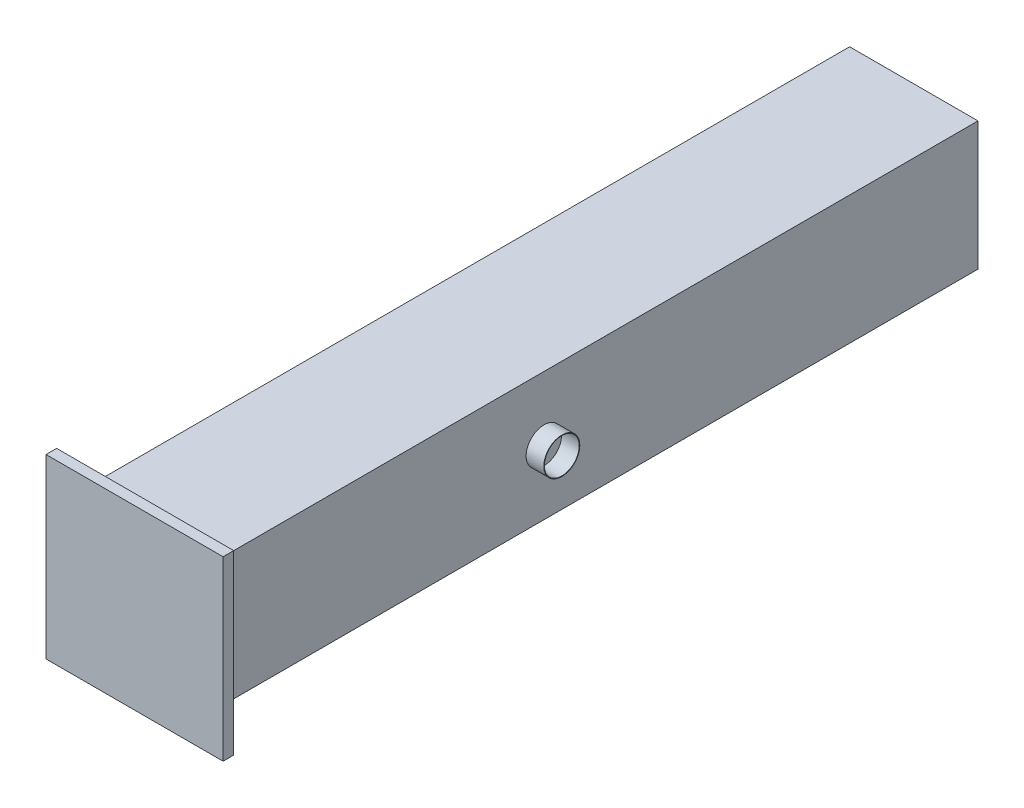
ISO-10303-21;
HEADER;
FILE_DESCRIPTION(('STEP AP214'),'2;1');
FILE_NAME('part.step','',(''),(''),'','','');
FILE_SCHEMA(('AUTOMOTIVE_DESIGN { 1 0 10303 214 1 1 1 1 }'));
ENDSEC;
DATA;
#1=APPLICATION_CONTEXT('core data for automotive mechanical design processes');
#2=APPLICATION_PROTOCOL_DEFINITION('international standard','automotive_design',2000,#1);
#3=PRODUCT_CONTEXT('',#1,'mechanical');
#4=PRODUCT('Part','Part','',(#3));
#5=PRODUCT_RELATED_PRODUCT_CATEGORY('part','',(#4));
#6=PRODUCT_DEFINITION_FORMATION('','',#4);
#7=PRODUCT_DEFINITION_CONTEXT('part definition',#1,'design');
#8=PRODUCT_DEFINITION('design','',#6,#7);
#9=PRODUCT_DEFINITION_SHAPE('','',#8);
#10=(LENGTH_UNIT() NAMED_UNIT(*) SI_UNIT(.MILLI.,.METRE.));
#11=(NAMED_UNIT(*) PLANE_ANGLE_UNIT() SI_UNIT($,.RADIAN.));
#12=(NAMED_UNIT(*) SI_UNIT($,.STERADIAN.) SOLID_ANGLE_UNIT());
#13=UNCERTAINTY_MEASURE_WITH_UNIT(LENGTH_MEASURE(1.E-05),#10,'distance_accuracy_value','');
#14=(GEOMETRIC_REPRESENTATION_CONTEXT(3) GLOBAL_UNCERTAINTY_ASSIGNED_CONTEXT((#13)) GLOBAL_UNIT_ASSIGNED_CONTEXT((#10,
#11,#12)) REPRESENTATION_CONTEXT('',''));
#15=CARTESIAN_POINT('',(0.,0.,0.));
#16=DIRECTION('',(0.,0.,1.));
#17=DIRECTION('',(1.,0.,0.));
#18=AXIS2_PLACEMENT_3D('',#15,#16,#17);
#19=CARTESIAN_POINT('',(-725.,-725.,8680.));
#20=DIRECTION('',(0.,1.,0.));
#21=DIRECTION('',(0.,0.,1.));
#22=AXIS2_PLACEMENT_3D('',#19,#20,#21);
#23=PLANE('',#22);
#24=DIRECTION('',(1.,0.,0.));
#25=VECTOR('',#24,1.);
#26=CARTESIAN_POINT('',(-725.,-725.,0.));
#27=LINE('',#26,#25);
#28=CARTESIAN_POINT('',(-725.,-725.,0.));
#29=VERTEX_POINT('',#28);
#30=CARTESIAN_POINT('',(725.,-725.,0.));
#31=VERTEX_POINT('',#30);
#32=EDGE_CURVE('E345',#29,#31,#27,.T.);
#33=ORIENTED_EDGE('',*,*,#32,.T.);
#34=DIRECTION('',(0.,0.,-1.));
#35=VECTOR('',#34,1.);
#36=CARTESIAN_POINT('',(725.,-725.,8680.));
#37=LINE('',#36,#35);
#38=CARTESIAN_POINT('',(725.,-725.,8680.));
#39=VERTEX_POINT('',#38);
#40=EDGE_CURVE('E351',#39,#31,#37,.T.);
#41=ORIENTED_EDGE('',*,*,#40,.F.);
#42=DIRECTION('',(1.,0.,0.));
#43=VECTOR('',#42,1.);
#44=CARTESIAN_POINT('',(-725.,-725.,8680.));
#45=LINE('',#44,#43);
#46=CARTESIAN_POINT('',(-725.,-725.,8680.));
#47=VERTEX_POINT('',#46);
#48=EDGE_CURVE('E110',#47,#39,#45,.T.);
#49=ORIENTED_EDGE('',*,*,#48,.F.);
#50=DIRECTION('',(0.,0.,-1.));
#51=VECTOR('',#50,1.);
#52=CARTESIAN_POINT('',(-725.,-725.,8680.));
#53=LINE('',#52,#51);
#54=EDGE_CURVE('E353',#47,#29,#53,.T.);
#55=ORIENTED_EDGE('',*,*,#54,.T.);
#56=EDGE_LOOP('',(#33,#41,#49,#55));
#57=FACE_BOUND('',#56,.T.);
#58=CARTESIAN_POINT('',(0.,-725.,1500.));
#59=DIRECTION('',(0.,1.,0.));
#60=DIRECTION('',(0.,0.,1.));
#61=AXIS2_PLACEMENT_3D('',#58,#59,#60);
#62=CIRCLE('',#61,254.);
#63=CARTESIAN_POINT('',(0.,-725.,1754.));
#64=VERTEX_POINT('',#63);
#65=EDGE_CURVE('E355',#64,#64,#62,.F.);
#66=ORIENTED_EDGE('',*,*,#65,.F.);
#67=EDGE_LOOP('',(#66));
#68=FACE_BOUND('',#67,.T.);
#69=CARTESIAN_POINT('',(0.,-725.,4900.));
#70=DIRECTION('',(0.,1.,0.));
#71=DIRECTION('',(0.,0.,1.));
#72=AXIS2_PLACEMENT_3D('',#69,#70,#71);
#73=CIRCLE('',#72,161.95);
#74=CARTESIAN_POINT('',(0.,-725.,5061.95));
#75=VERTEX_POINT('',#74);
#76=EDGE_CURVE('E358',#75,#75,#73,.F.);
#77=ORIENTED_EDGE('',*,*,#76,.F.);
#78=EDGE_LOOP('',(#77));
#79=FACE_BOUND('',#78,.T.);
#80=CARTESIAN_POINT('',(0.,-725.,35.));
#81=DIRECTION('',(0.,1.,0.));
#82=DIRECTION('',(0.,0.,1.));
#83=AXIS2_PLACEMENT_3D('',#80,#81,#82);
#84=CIRCLE('',#83,17.15);
#85=CARTESIAN_POINT('',(0.,-725.,52.15));
#86=VERTEX_POINT('',#85);
#87=EDGE_CURVE('E12',#86,#86,#84,.F.);
#88=ORIENTED_EDGE('',*,*,#87,.F.);
#89=EDGE_LOOP('',(#88));
#90=FACE_BOUND('',#89,.T.);
#91=ADVANCED_FACE('F66',(#57,#68,#79,#90),#23,.F.);
#92=CARTESIAN_POINT('',(725.,725.,8680.));
#93=DIRECTION('',(-1.,0.,0.));
#94=DIRECTION('',(0.,-1.,0.));
#95=AXIS2_PLACEMENT_3D('',#92,#93,#94);
#96=PLANE('',#95);
#97=DIRECTION('',(0.,1.,0.));
#98=VECTOR('',#97,1.);
#99=CARTESIAN_POINT('',(725.,725.,0.));
#100=LINE('',#99,#98);
#101=CARTESIAN_POINT('',(725.,725.,0.));
#102=VERTEX_POINT('',#101);
#103=EDGE_CURVE('E99',#31,#102,#100,.T.);
#104=ORIENTED_EDGE('',*,*,#103,.T.);
#105=DIRECTION('',(0.,0.,-1.));
#106=VECTOR('',#105,1.);
#107=CARTESIAN_POINT('',(725.,725.,8680.));
#108=LINE('',#107,#106);
#109=CARTESIAN_POINT('',(725.,725.,8680.));
#110=VERTEX_POINT('',#109);
#111=EDGE_CURVE('E83',#110,#102,#108,.T.);
#112=ORIENTED_EDGE('',*,*,#111,.F.);
#113=DIRECTION('',(0.,1.,0.));
#114=VECTOR('',#113,1.);
#115=CARTESIAN_POINT('',(725.,725.,8680.));
#116=LINE('',#115,#114);
#117=EDGE_CURVE('E336',#39,#110,#116,.T.);
#118=ORIENTED_EDGE('',*,*,#117,.F.);
#119=ORIENTED_EDGE('',*,*,#40,.T.);
#120=EDGE_LOOP('',(#104,#112,#118,#119));
#121=FACE_BOUND('',#120,.T.);
#122=CARTESIAN_POINT('',(725.,-5.44565780350945E-13,4900.));
#123=DIRECTION('',(-1.,0.,0.));
#124=DIRECTION('',(0.,-1.,0.));
#125=AXIS2_PLACEMENT_3D('',#122,#123,#124);
#126=CIRCLE('',#125,203.2);
#127=CARTESIAN_POINT('',(725.,-203.2,4900.));
#128=VERTEX_POINT('',#127);
#129=EDGE_CURVE('E75',#128,#128,#126,.F.);
#130=ORIENTED_EDGE('',*,*,#129,.F.);
#131=EDGE_LOOP('',(#130));
#132=FACE_BOUND('',#131,.T.);
#133=ADVANCED_FACE('F371',(#121,#132),#96,.F.);
#134=CARTESIAN_POINT('',(-725.,725.,8680.));
#135=DIRECTION('',(1.,0.,0.));
#136=DIRECTION('',(0.,1.,0.));
#137=AXIS2_PLACEMENT_3D('',#134,#135,#136);
#138=PLANE('',#137);
#139=DIRECTION('',(0.,-1.,0.));
#140=VECTOR('',#139,1.);
#141=CARTESIAN_POINT('',(-725.,725.,0.));
#142=LINE('',#141,#140);
#143=CARTESIAN_POINT('',(-725.,725.,0.));
#144=VERTEX_POINT('',#143);
#145=EDGE_CURVE('E331',#144,#29,#142,.T.);
#146=ORIENTED_EDGE('',*,*,#145,.T.);
#147=ORIENTED_EDGE('',*,*,#54,.F.);
#148=DIRECTION('',(0.,-1.,0.));
#149=VECTOR('',#148,1.);
#150=CARTESIAN_POINT('',(-725.,725.,8680.));
#151=LINE('',#150,#149);
#152=CARTESIAN_POINT('',(-725.,725.,8680.));
#153=VERTEX_POINT('',#152);
#154=EDGE_CURVE('E332',#153,#47,#151,.T.);
#155=ORIENTED_EDGE('',*,*,#154,.F.);
#156=DIRECTION('',(0.,0.,-1.));
#157=VECTOR('',#156,1.);
#158=CARTESIAN_POINT('',(-725.,725.,8680.));
#159=LINE('',#158,#157);
#160=EDGE_CURVE('E342',#153,#144,#159,.T.);
#161=ORIENTED_EDGE('',*,*,#160,.T.);
#162=EDGE_LOOP('',(#146,#147,#155,#161));
#163=FACE_BOUND('',#162,.T.);
#164=CARTESIAN_POINT('',(-725.,0.,4900.));
#165=DIRECTION('',(1.,0.,0.));
#166=DIRECTION('',(0.,1.,0.));
#167=AXIS2_PLACEMENT_3D('',#164,#165,#166);
#168=CIRCLE('',#167,304.999999999999);
#169=CARTESIAN_POINT('',(-725.,304.999999999999,4900.));
#170=VERTEX_POINT('',#169);
#171=EDGE_CURVE('E361',#170,#170,#168,.F.);
#172=ORIENTED_EDGE('',*,*,#171,.F.);
#173=EDGE_LOOP('',(#172));
#174=FACE_BOUND('',#173,.T.);
#175=CARTESIAN_POINT('',(-725.,0.,1000.));
#176=DIRECTION('',(1.,0.,0.));
#177=DIRECTION('',(0.,1.,0.));
#178=AXIS2_PLACEMENT_3D('',#175,#176,#177);
#179=CIRCLE('',#178,305.);
#180=CARTESIAN_POINT('',(-725.,305.,1000.));
#181=VERTEX_POINT('',#180);
#182=EDGE_CURVE('E364',#181,#181,#179,.F.);
#183=ORIENTED_EDGE('',*,*,#182,.F.);
#184=EDGE_LOOP('',(#183));
#185=FACE_BOUND('',#184,.T.);
#186=ADVANCED_FACE('F373',(#163,#174,#185),#138,.F.);
#187=CARTESIAN_POINT('',(-725.,725.,8680.));
#188=DIRECTION('',(0.,-1.,0.));
#189=DIRECTION('',(0.,0.,-1.));
#190=AXIS2_PLACEMENT_3D('',#187,#188,#189);
#191=PLANE('',#190);
#192=DIRECTION('',(-1.,0.,0.));
#193=VECTOR('',#192,1.);
#194=CARTESIAN_POINT('',(-725.,725.,0.));
#195=LINE('',#194,#193);
#196=EDGE_CURVE('E104',#102,#144,#195,.T.);
#197=ORIENTED_EDGE('',*,*,#196,.T.);
#198=ORIENTED_EDGE('',*,*,#160,.F.);
#199=DIRECTION('',(-1.,0.,0.));
#200=VECTOR('',#199,1.);
#201=CARTESIAN_POINT('',(-725.,725.,8680.));
#202=LINE('',#201,#200);
#203=EDGE_CURVE('E339',#110,#153,#202,.T.);
#204=ORIENTED_EDGE('',*,*,#203,.F.);
#205=ORIENTED_EDGE('',*,*,#111,.T.);
#206=EDGE_LOOP('',(#197,#198,#204,#205));
#207=FACE_BOUND('',#206,.T.);
#208=ADVANCED_FACE('F380',(#207),#191,.F.);
#209=CARTESIAN_POINT('',(-725.,-725.,0.));
#210=DIRECTION('',(0.,0.,1.));
#211=DIRECTION('',(1.,0.,0.));
#212=AXIS2_PLACEMENT_3D('',#209,#210,#211);
#213=PLANE('',#212);
#214=ORIENTED_EDGE('',*,*,#145,.F.);
#215=ORIENTED_EDGE('',*,*,#196,.F.);
#216=ORIENTED_EDGE('',*,*,#103,.F.);
#217=ORIENTED_EDGE('',*,*,#32,.F.);
#218=EDGE_LOOP('',(#214,#215,#216,#217));
#219=FACE_BOUND('',#218,.T.);
#220=ADVANCED_FACE('F503',(#219),#213,.F.);
#221=CARTESIAN_POINT('',(-1000.,1000.,8680.));
#222=DIRECTION('',(0.,0.,1.));
#223=DIRECTION('',(1.,0.,0.));
#224=AXIS2_PLACEMENT_3D('',#221,#222,#223);
#225=PLANE('',#224);
#226=DIRECTION('',(-1.,0.,0.));
#227=VECTOR('',#226,1.);
#228=CARTESIAN_POINT('',(1000.,1000.,8680.));
#229=LINE('',#228,#227);
#230=CARTESIAN_POINT('',(1000.,1000.,8680.));
#231=VERTEX_POINT('',#230);
#232=CARTESIAN_POINT('',(-1000.,1000.,8680.));
#233=VERTEX_POINT('',#232);
#234=EDGE_CURVE('E301',#231,#233,#229,.T.);
#235=ORIENTED_EDGE('',*,*,#234,.F.);
#236=DIRECTION('',(0.,1.,0.));
#237=VECTOR('',#236,1.);
#238=CARTESIAN_POINT('',(1000.,-1000.,8680.));
#239=LINE('',#238,#237);
#240=CARTESIAN_POINT('',(1000.,-1000.,8680.));
#241=VERTEX_POINT('',#240);
#242=EDGE_CURVE('E306',#241,#231,#239,.T.);
#243=ORIENTED_EDGE('',*,*,#242,.F.);
#244=DIRECTION('',(1.,0.,0.));
#245=VECTOR('',#244,1.);
#246=CARTESIAN_POINT('',(-1000.,-1000.,8680.));
#247=LINE('',#246,#245);
#248=CARTESIAN_POINT('',(-1000.,-1000.,8680.));
#249=VERTEX_POINT('',#248);
#250=EDGE_CURVE('E317',#249,#241,#247,.T.);
#251=ORIENTED_EDGE('',*,*,#250,.F.);
#252=DIRECTION('',(0.,-1.,0.));
#253=VECTOR('',#252,1.);
#254=CARTESIAN_POINT('',(-1000.,1000.,8680.));
#255=LINE('',#254,#253);
#256=EDGE_CURVE('E315',#233,#249,#255,.T.);
#257=ORIENTED_EDGE('',*,*,#256,.F.);
#258=EDGE_LOOP('',(#235,#243,#251,#257));
#259=FACE_BOUND('',#258,.T.);
#260=ORIENTED_EDGE('',*,*,#203,.T.);
#261=ORIENTED_EDGE('',*,*,#154,.T.);
#262=ORIENTED_EDGE('',*,*,#48,.T.);
#263=ORIENTED_EDGE('',*,*,#117,.T.);
#264=EDGE_LOOP('',(#260,#261,#262,#263));
#265=FACE_BOUND('',#264,.T.);
#266=ADVANCED_FACE('F499',(#259,#265),#225,.F.);
#267=CARTESIAN_POINT('',(1000.,1000.,8800.));
#268=DIRECTION('',(0.,-1.,0.));
#269=DIRECTION('',(0.,0.,-1.));
#270=AXIS2_PLACEMENT_3D('',#267,#268,#269);
#271=PLANE('',#270);
#272=ORIENTED_EDGE('',*,*,#234,.T.);
#273=DIRECTION('',(0.,0.,-1.));
#274=VECTOR('',#273,1.);
#275=CARTESIAN_POINT('',(-1000.,1000.,8800.));
#276=LINE('',#275,#274);
#277=CARTESIAN_POINT('',(-1000.,1000.,8800.));
#278=VERTEX_POINT('',#277);
#279=EDGE_CURVE('E328',#278,#233,#276,.T.);
#280=ORIENTED_EDGE('',*,*,#279,.F.);
#281=DIRECTION('',(-1.,0.,0.));
#282=VECTOR('',#281,1.);
#283=CARTESIAN_POINT('',(1000.,1000.,8800.));
#284=LINE('',#283,#282);
#285=CARTESIAN_POINT('',(1000.,1000.,8800.));
#286=VERTEX_POINT('',#285);
#287=EDGE_CURVE('E302',#286,#278,#284,.T.);
#288=ORIENTED_EDGE('',*,*,#287,.F.);
#289=DIRECTION('',(0.,0.,-1.));
#290=VECTOR('',#289,1.);
#291=CARTESIAN_POINT('',(1000.,1000.,8800.));
#292=LINE('',#291,#290);
#293=EDGE_CURVE('E312',#286,#231,#292,.T.);
#294=ORIENTED_EDGE('',*,*,#293,.T.);
#295=EDGE_LOOP('',(#272,#280,#288,#294));
#296=FACE_BOUND('',#295,.T.);
#297=ADVANCED_FACE('F502',(#296),#271,.F.);
#298=CARTESIAN_POINT('',(-1000.,1000.,8800.));
#299=DIRECTION('',(1.,0.,0.));
#300=DIRECTION('',(0.,1.,0.));
#301=AXIS2_PLACEMENT_3D('',#298,#299,#300);
#302=PLANE('',#301);
#303=ORIENTED_EDGE('',*,*,#256,.T.);
#304=DIRECTION('',(0.,0.,-1.));
#305=VECTOR('',#304,1.);
#306=CARTESIAN_POINT('',(-1000.,-1000.,8800.));
#307=LINE('',#306,#305);
#308=CARTESIAN_POINT('',(-1000.,-1000.,8800.));
#309=VERTEX_POINT('',#308);
#310=EDGE_CURVE('E325',#309,#249,#307,.T.);
#311=ORIENTED_EDGE('',*,*,#310,.F.);
#312=DIRECTION('',(0.,-1.,0.));
#313=VECTOR('',#312,1.);
#314=CARTESIAN_POINT('',(-1000.,1000.,8800.));
#315=LINE('',#314,#313);
#316=EDGE_CURVE('E305',#278,#309,#315,.T.);
#317=ORIENTED_EDGE('',*,*,#316,.F.);
#318=ORIENTED_EDGE('',*,*,#279,.T.);
#319=EDGE_LOOP('',(#303,#311,#317,#318));
#320=FACE_BOUND('',#319,.T.);
#321=ADVANCED_FACE('F511',(#320),#302,.F.);
#322=CARTESIAN_POINT('',(-1000.,-1000.,8800.));
#323=DIRECTION('',(0.,1.,0.));
#324=DIRECTION('',(0.,0.,1.));
#325=AXIS2_PLACEMENT_3D('',#322,#323,#324);
#326=PLANE('',#325);
#327=ORIENTED_EDGE('',*,*,#250,.T.);
#328=DIRECTION('',(0.,0.,-1.));
#329=VECTOR('',#328,1.);
#330=CARTESIAN_POINT('',(1000.,-1000.,8800.));
#331=LINE('',#330,#329);
#332=CARTESIAN_POINT('',(1000.,-1000.,8800.));
#333=VERTEX_POINT('',#332);
#334=EDGE_CURVE('E322',#333,#241,#331,.T.);
#335=ORIENTED_EDGE('',*,*,#334,.F.);
#336=DIRECTION('',(1.,0.,0.));
#337=VECTOR('',#336,1.);
#338=CARTESIAN_POINT('',(-1000.,-1000.,8800.));
#339=LINE('',#338,#337);
#340=EDGE_CURVE('E308',#309,#333,#339,.T.);
#341=ORIENTED_EDGE('',*,*,#340,.F.);
#342=ORIENTED_EDGE('',*,*,#310,.T.);
#343=EDGE_LOOP('',(#327,#335,#341,#342));
#344=FACE_BOUND('',#343,.T.);
#345=ADVANCED_FACE('F507',(#344),#326,.F.);
#346=CARTESIAN_POINT('',(1000.,-1000.,8800.));
#347=DIRECTION('',(-1.,0.,0.));
#348=DIRECTION('',(0.,-1.,0.));
#349=AXIS2_PLACEMENT_3D('',#346,#347,#348);
#350=PLANE('',#349);
#351=ORIENTED_EDGE('',*,*,#242,.T.);
#352=ORIENTED_EDGE('',*,*,#293,.F.);
#353=DIRECTION('',(0.,1.,0.));
#354=VECTOR('',#353,1.);
#355=CARTESIAN_POINT('',(1000.,-1000.,8800.));
#356=LINE('',#355,#354);
#357=EDGE_CURVE('E310',#333,#286,#356,.T.);
#358=ORIENTED_EDGE('',*,*,#357,.F.);
#359=ORIENTED_EDGE('',*,*,#334,.T.);
#360=EDGE_LOOP('',(#351,#352,#358,#359));
#361=FACE_BOUND('',#360,.T.);
#362=ADVANCED_FACE('F497',(#361),#350,.F.);
#363=CARTESIAN_POINT('',(-1000.,1000.,8800.));
#364=DIRECTION('',(0.,0.,1.));
#365=DIRECTION('',(1.,0.,0.));
#366=AXIS2_PLACEMENT_3D('',#363,#364,#365);
#367=PLANE('',#366);
#368=ORIENTED_EDGE('',*,*,#287,.T.);
#369=ORIENTED_EDGE('',*,*,#316,.T.);
#370=ORIENTED_EDGE('',*,*,#340,.T.);
#371=ORIENTED_EDGE('',*,*,#357,.T.);
#372=EDGE_LOOP('',(#368,#369,#370,#371));
#373=FACE_BOUND('',#372,.T.);
#374=ADVANCED_FACE('F490',(#373),#367,.T.);
#375=CARTESIAN_POINT('',(0.,-925.,1500.));
#376=DIRECTION('',(0.,-1.,0.));
#377=DIRECTION('',(0.,0.,-1.));
#378=AXIS2_PLACEMENT_3D('',#375,#376,#377);
#379=PLANE('',#378);
#380=CARTESIAN_POINT('',(0.,-925.,1500.));
#381=DIRECTION('',(0.,-1.,0.));
#382=DIRECTION('',(0.,0.,-1.));
#383=AXIS2_PLACEMENT_3D('',#380,#381,#382);
#384=CIRCLE('',#383,254.);
#385=CARTESIAN_POINT('',(0.,-925.,1246.));
#386=VERTEX_POINT('',#385);
#387=EDGE_CURVE('E296',#386,#386,#384,.T.);
#388=ORIENTED_EDGE('',*,*,#387,.T.);
#389=EDGE_LOOP('',(#388));
#390=FACE_BOUND('',#389,.T.);
#391=CARTESIAN_POINT('',(0.,-925.,1500.));
#392=DIRECTION('',(0.,-1.,0.));
#393=DIRECTION('',(1.,0.,0.));
#394=AXIS2_PLACEMENT_3D('',#391,#392,#393);
#395=CIRCLE('',#394,247.7);
#396=CARTESIAN_POINT('',(247.7,-925.,1500.));
#397=VERTEX_POINT('',#396);
#398=EDGE_CURVE('E293',#397,#397,#395,.T.);
#399=ORIENTED_EDGE('',*,*,#398,.F.);
#400=EDGE_LOOP('',(#399));
#401=FACE_BOUND('',#400,.T.);
#402=ADVANCED_FACE('F487',(#390,#401),#379,.T.);
#403=CARTESIAN_POINT('',(0.,-925.,1500.));
#404=DIRECTION('',(0.,1.,0.));
#405=DIRECTION('',(0.,0.,1.));
#406=AXIS2_PLACEMENT_3D('',#403,#404,#405);
#407=CYLINDRICAL_SURFACE('',#406,254.);
#408=ORIENTED_EDGE('',*,*,#387,.F.);
#409=EDGE_LOOP('',(#408));
#410=FACE_BOUND('',#409,.T.);
#411=ORIENTED_EDGE('',*,*,#65,.T.);
#412=EDGE_LOOP('',(#411));
#413=FACE_BOUND('',#412,.T.);
#414=ADVANCED_FACE('F485',(#410,#413),#407,.T.);
#415=CARTESIAN_POINT('',(0.,-925.,1500.));
#416=DIRECTION('',(0.,1.,0.));
#417=DIRECTION('',(0.,0.,1.));
#418=AXIS2_PLACEMENT_3D('',#415,#416,#417);
#419=CYLINDRICAL_SURFACE('',#418,247.7);
#420=ORIENTED_EDGE('',*,*,#398,.T.);
#421=EDGE_LOOP('',(#420));
#422=FACE_BOUND('',#421,.T.);
#423=CARTESIAN_POINT('',(0.,-725.,1500.));
#424=DIRECTION('',(0.,-1.,0.));
#425=DIRECTION('',(1.,0.,0.));
#426=AXIS2_PLACEMENT_3D('',#423,#424,#425);
#427=CIRCLE('',#426,247.7);
#428=CARTESIAN_POINT('',(247.7,-725.,1500.));
#429=VERTEX_POINT('',#428);
#430=EDGE_CURVE('E292',#429,#429,#427,.T.);
#431=ORIENTED_EDGE('',*,*,#430,.F.);
#432=EDGE_LOOP('',(#431));
#433=FACE_BOUND('',#432,.T.);
#434=ADVANCED_FACE('F482',(#422,#433),#419,.F.);
#435=CARTESIAN_POINT('',(0.,-725.,1500.));
#436=DIRECTION('',(0.,1.,0.));
#437=DIRECTION('',(0.,0.,1.));
#438=AXIS2_PLACEMENT_3D('',#435,#436,#437);
#439=CIRCLE('',#438,244.);
#440=CARTESIAN_POINT('',(0.,-725.,1744.));
#441=VERTEX_POINT('',#440);
#442=EDGE_CURVE('E252',#441,#441,#439,.T.);
#443=ORIENTED_EDGE('',*,*,#442,.T.);
#444=EDGE_LOOP('',(#443));
#445=FACE_BOUND('',#444,.T.);
#446=ORIENTED_EDGE('',*,*,#430,.T.);
#447=EDGE_LOOP('',(#446));
#448=FACE_BOUND('',#447,.T.);
#449=ADVANCED_FACE('F384',(#445,#448),#23,.F.);
#450=CARTESIAN_POINT('',(0.,-925.,4900.));
#451=DIRECTION('',(0.,-1.,0.));
#452=DIRECTION('',(0.,0.,-1.));
#453=AXIS2_PLACEMENT_3D('',#450,#451,#452);
#454=PLANE('',#453);
#455=CARTESIAN_POINT('',(0.,-925.,4900.));
#456=DIRECTION('',(0.,-1.,0.));
#457=DIRECTION('',(0.,0.,-1.));
#458=AXIS2_PLACEMENT_3D('',#455,#456,#457);
#459=CIRCLE('',#458,161.95);
#460=CARTESIAN_POINT('',(0.,-925.,4738.05));
#461=VERTEX_POINT('',#460);
#462=EDGE_CURVE('E287',#461,#461,#459,.T.);
#463=ORIENTED_EDGE('',*,*,#462,.T.);
#464=EDGE_LOOP('',(#463));
#465=FACE_BOUND('',#464,.T.);
#466=CARTESIAN_POINT('',(0.,-925.,4900.));
#467=DIRECTION('',(0.,-1.,0.));
#468=DIRECTION('',(1.,0.,0.));
#469=AXIS2_PLACEMENT_3D('',#466,#467,#468);
#470=CIRCLE('',#469,155.65);
#471=CARTESIAN_POINT('',(155.65,-925.,4900.));
#472=VERTEX_POINT('',#471);
#473=EDGE_CURVE('E284',#472,#472,#470,.T.);
#474=ORIENTED_EDGE('',*,*,#473,.F.);
#475=EDGE_LOOP('',(#474));
#476=FACE_BOUND('',#475,.T.);
#477=ADVANCED_FACE('F472',(#465,#476),#454,.T.);
#478=CARTESIAN_POINT('',(0.,-925.,4900.));
#479=DIRECTION('',(0.,1.,0.));
#480=DIRECTION('',(0.,0.,1.));
#481=AXIS2_PLACEMENT_3D('',#478,#479,#480);
#482=CYLINDRICAL_SURFACE('',#481,161.95);
#483=ORIENTED_EDGE('',*,*,#462,.F.);
#484=EDGE_LOOP('',(#483));
#485=FACE_BOUND('',#484,.T.);
#486=ORIENTED_EDGE('',*,*,#76,.T.);
#487=EDGE_LOOP('',(#486));
#488=FACE_BOUND('',#487,.T.);
#489=ADVANCED_FACE('F466',(#485,#488),#482,.T.);
#490=CARTESIAN_POINT('',(0.,-925.,4900.));
#491=DIRECTION('',(0.,1.,0.));
#492=DIRECTION('',(0.,0.,1.));
#493=AXIS2_PLACEMENT_3D('',#490,#491,#492);
#494=CYLINDRICAL_SURFACE('',#493,155.65);
#495=ORIENTED_EDGE('',*,*,#473,.T.);
#496=EDGE_LOOP('',(#495));
#497=FACE_BOUND('',#496,.T.);
#498=CARTESIAN_POINT('',(0.,-725.,4900.));
#499=DIRECTION('',(0.,-1.,0.));
#500=DIRECTION('',(1.,0.,0.));
#501=AXIS2_PLACEMENT_3D('',#498,#499,#500);
#502=CIRCLE('',#501,155.65);
#503=CARTESIAN_POINT('',(155.65,-725.,4900.));
#504=VERTEX_POINT('',#503);
#505=EDGE_CURVE('E283',#504,#504,#502,.T.);
#506=ORIENTED_EDGE('',*,*,#505,.F.);
#507=EDGE_LOOP('',(#506));
#508=FACE_BOUND('',#507,.T.);
#509=ADVANCED_FACE('F462',(#497,#508),#494,.F.);
#510=CARTESIAN_POINT('',(0.,-725.,4900.));
#511=DIRECTION('',(0.,1.,0.));
#512=DIRECTION('',(0.,0.,1.));
#513=AXIS2_PLACEMENT_3D('',#510,#511,#512);
#514=CIRCLE('',#513,151.95);
#515=CARTESIAN_POINT('',(0.,-725.,5051.95));
#516=VERTEX_POINT('',#515);
#517=EDGE_CURVE('E255',#516,#516,#514,.T.);
#518=ORIENTED_EDGE('',*,*,#517,.T.);
#519=EDGE_LOOP('',(#518));
#520=FACE_BOUND('',#519,.T.);
#521=ORIENTED_EDGE('',*,*,#505,.T.);
#522=EDGE_LOOP('',(#521));
#523=FACE_BOUND('',#522,.T.);
#524=ADVANCED_FACE('F458',(#520,#523),#23,.F.);
#525=CARTESIAN_POINT('',(-875.,0.,4900.));
#526=DIRECTION('',(-1.,0.,0.));
#527=DIRECTION('',(0.,-1.,0.));
#528=AXIS2_PLACEMENT_3D('',#525,#526,#527);
#529=PLANE('',#528);
#530=CARTESIAN_POINT('',(-875.,0.,4900.));
#531=DIRECTION('',(-1.,0.,0.));
#532=DIRECTION('',(0.,-1.,0.));
#533=AXIS2_PLACEMENT_3D('',#530,#531,#532);
#534=CIRCLE('',#533,304.999999999999);
#535=CARTESIAN_POINT('',(-875.,-304.999999999999,4900.));
#536=VERTEX_POINT('',#535);
#537=EDGE_CURVE('E278',#536,#536,#534,.T.);
#538=ORIENTED_EDGE('',*,*,#537,.T.);
#539=EDGE_LOOP('',(#538));
#540=FACE_BOUND('',#539,.T.);
#541=CARTESIAN_POINT('',(-875.,0.,4900.));
#542=DIRECTION('',(-1.,0.,0.));
#543=DIRECTION('',(0.,0.,1.));
#544=AXIS2_PLACEMENT_3D('',#541,#542,#543);
#545=CIRCLE('',#544,298.699999999999);
#546=CARTESIAN_POINT('',(-875.,0.,5198.7));
#547=VERTEX_POINT('',#546);
#548=EDGE_CURVE('E275',#547,#547,#545,.T.);
#549=ORIENTED_EDGE('',*,*,#548,.F.);
#550=EDGE_LOOP('',(#549));
#551=FACE_BOUND('',#550,.T.);
#552=ADVANCED_FACE('F461',(#540,#551),#529,.T.);
#553=CARTESIAN_POINT('',(-875.,0.,4900.));
#554=DIRECTION('',(1.,0.,0.));
#555=DIRECTION('',(0.,1.,0.));
#556=AXIS2_PLACEMENT_3D('',#553,#554,#555);
#557=CYLINDRICAL_SURFACE('',#556,304.999999999999);
#558=ORIENTED_EDGE('',*,*,#537,.F.);
#559=EDGE_LOOP('',(#558));
#560=FACE_BOUND('',#559,.T.);
#561=ORIENTED_EDGE('',*,*,#171,.T.);
#562=EDGE_LOOP('',(#561));
#563=FACE_BOUND('',#562,.T.);
#564=ADVANCED_FACE('F477',(#560,#563),#557,.T.);
#565=CARTESIAN_POINT('',(-875.,0.,4900.));
#566=DIRECTION('',(1.,0.,0.));
#567=DIRECTION('',(0.,1.,0.));
#568=AXIS2_PLACEMENT_3D('',#565,#566,#567);
#569=CYLINDRICAL_SURFACE('',#568,298.699999999999);
#570=ORIENTED_EDGE('',*,*,#548,.T.);
#571=EDGE_LOOP('',(#570));
#572=FACE_BOUND('',#571,.T.);
#573=CARTESIAN_POINT('',(-725.,0.,4900.));
#574=DIRECTION('',(-1.,0.,0.));
#575=DIRECTION('',(0.,0.,1.));
#576=AXIS2_PLACEMENT_3D('',#573,#574,#575);
#577=CIRCLE('',#576,298.699999999999);
#578=CARTESIAN_POINT('',(-725.,0.,5198.7));
#579=VERTEX_POINT('',#578);
#580=EDGE_CURVE('E274',#579,#579,#577,.T.);
#581=ORIENTED_EDGE('',*,*,#580,.F.);
#582=EDGE_LOOP('',(#581));
#583=FACE_BOUND('',#582,.T.);
#584=ADVANCED_FACE('F608',(#572,#583),#569,.F.);
#585=CARTESIAN_POINT('',(-725.,0.,4900.));
#586=DIRECTION('',(1.,0.,0.));
#587=DIRECTION('',(0.,1.,0.));
#588=AXIS2_PLACEMENT_3D('',#585,#586,#587);
#589=CIRCLE('',#588,294.999999999999);
#590=CARTESIAN_POINT('',(-725.,294.999999999999,4900.));
#591=VERTEX_POINT('',#590);
#592=EDGE_CURVE('E259',#591,#591,#589,.T.);
#593=ORIENTED_EDGE('',*,*,#592,.T.);
#594=EDGE_LOOP('',(#593));
#595=FACE_BOUND('',#594,.T.);
#596=ORIENTED_EDGE('',*,*,#580,.T.);
#597=EDGE_LOOP('',(#596));
#598=FACE_BOUND('',#597,.T.);
#599=ADVANCED_FACE('F68',(#595,#598),#138,.F.);
#600=CARTESIAN_POINT('',(-875.,0.,1000.));
#601=DIRECTION('',(-1.,0.,0.));
#602=DIRECTION('',(0.,-1.,0.));
#603=AXIS2_PLACEMENT_3D('',#600,#601,#602);
#604=PLANE('',#603);
#605=CARTESIAN_POINT('',(-875.,0.,1000.));
#606=DIRECTION('',(-1.,0.,0.));
#607=DIRECTION('',(0.,-1.,0.));
#608=AXIS2_PLACEMENT_3D('',#605,#606,#607);
#609=CIRCLE('',#608,305.);
#610=CARTESIAN_POINT('',(-875.,-305.,1000.));
#611=VERTEX_POINT('',#610);
#612=EDGE_CURVE('E269',#611,#611,#609,.T.);
#613=ORIENTED_EDGE('',*,*,#612,.T.);
#614=EDGE_LOOP('',(#613));
#615=FACE_BOUND('',#614,.T.);
#616=CARTESIAN_POINT('',(-875.,0.,1000.));
#617=DIRECTION('',(-1.,0.,0.));
#618=DIRECTION('',(0.,0.,1.));
#619=AXIS2_PLACEMENT_3D('',#616,#617,#618);
#620=CIRCLE('',#619,298.7);
#621=CARTESIAN_POINT('',(-875.,0.,1298.7));
#622=VERTEX_POINT('',#621);
#623=EDGE_CURVE('E266',#622,#622,#620,.T.);
#624=ORIENTED_EDGE('',*,*,#623,.F.);
#625=EDGE_LOOP('',(#624));
#626=FACE_BOUND('',#625,.T.);
#627=ADVANCED_FACE('F624',(#615,#626),#604,.T.);
#628=CARTESIAN_POINT('',(-875.,0.,1000.));
#629=DIRECTION('',(1.,0.,0.));
#630=DIRECTION('',(0.,1.,0.));
#631=AXIS2_PLACEMENT_3D('',#628,#629,#630);
#632=CYLINDRICAL_SURFACE('',#631,305.);
#633=ORIENTED_EDGE('',*,*,#612,.F.);
#634=EDGE_LOOP('',(#633));
#635=FACE_BOUND('',#634,.T.);
#636=ORIENTED_EDGE('',*,*,#182,.T.);
#637=EDGE_LOOP('',(#636));
#638=FACE_BOUND('',#637,.T.);
#639=ADVANCED_FACE('F628',(#635,#638),#632,.T.);
#640=CARTESIAN_POINT('',(-875.,0.,1000.));
#641=DIRECTION('',(1.,0.,0.));
#642=DIRECTION('',(0.,1.,0.));
#643=AXIS2_PLACEMENT_3D('',#640,#641,#642);
#644=CYLINDRICAL_SURFACE('',#643,298.7);
#645=ORIENTED_EDGE('',*,*,#623,.T.);
#646=EDGE_LOOP('',(#645));
#647=FACE_BOUND('',#646,.T.);
#648=CARTESIAN_POINT('',(-725.,0.,1000.));
#649=DIRECTION('',(-1.,0.,0.));
#650=DIRECTION('',(0.,0.,1.));
#651=AXIS2_PLACEMENT_3D('',#648,#649,#650);
#652=CIRCLE('',#651,298.7);
#653=CARTESIAN_POINT('',(-725.,0.,1298.7));
#654=VERTEX_POINT('',#653);
#655=EDGE_CURVE('E265',#654,#654,#652,.T.);
#656=ORIENTED_EDGE('',*,*,#655,.F.);
#657=EDGE_LOOP('',(#656));
#658=FACE_BOUND('',#657,.T.);
#659=ADVANCED_FACE('F637',(#647,#658),#644,.F.);
#660=CARTESIAN_POINT('',(-725.,0.,1000.));
#661=DIRECTION('',(1.,0.,0.));
#662=DIRECTION('',(0.,1.,0.));
#663=AXIS2_PLACEMENT_3D('',#660,#661,#662);
#664=CIRCLE('',#663,295.);
#665=CARTESIAN_POINT('',(-725.,295.,1000.));
#666=VERTEX_POINT('',#665);
#667=EDGE_CURVE('E262',#666,#666,#664,.T.);
#668=ORIENTED_EDGE('',*,*,#667,.T.);
#669=EDGE_LOOP('',(#668));
#670=FACE_BOUND('',#669,.T.);
#671=ORIENTED_EDGE('',*,*,#655,.T.);
#672=EDGE_LOOP('',(#671));
#673=FACE_BOUND('',#672,.T.);
#674=ADVANCED_FACE('F382',(#670,#673),#138,.F.);
#675=CARTESIAN_POINT('',(-875.,0.,1000.));
#676=DIRECTION('',(1.,0.,0.));
#677=DIRECTION('',(0.,1.,0.));
#678=AXIS2_PLACEMENT_3D('',#675,#676,#677);
#679=CYLINDRICAL_SURFACE('',#678,295.);
#680=CARTESIAN_POINT('',(-715.,0.,1000.));
#681=DIRECTION('',(1.,0.,0.));
#682=DIRECTION('',(0.,1.,0.));
#683=AXIS2_PLACEMENT_3D('',#680,#681,#682);
#684=CIRCLE('',#683,295.);
#685=CARTESIAN_POINT('',(-715.,295.,1000.));
#686=VERTEX_POINT('',#685);
#687=EDGE_CURVE('E256',#686,#686,#684,.F.);
#688=ORIENTED_EDGE('',*,*,#687,.F.);
#689=EDGE_LOOP('',(#688));
#690=FACE_BOUND('',#689,.T.);
#691=ORIENTED_EDGE('',*,*,#667,.F.);
#692=EDGE_LOOP('',(#691));
#693=FACE_BOUND('',#692,.T.);
#694=ADVANCED_FACE('F656',(#690,#693),#679,.F.);
#695=CARTESIAN_POINT('',(-875.,0.,4900.));
#696=DIRECTION('',(1.,0.,0.));
#697=DIRECTION('',(0.,1.,0.));
#698=AXIS2_PLACEMENT_3D('',#695,#696,#697);
#699=CYLINDRICAL_SURFACE('',#698,294.999999999999);
#700=CARTESIAN_POINT('',(-715.,0.,4900.));
#701=DIRECTION('',(1.,0.,0.));
#702=DIRECTION('',(0.,1.,0.));
#703=AXIS2_PLACEMENT_3D('',#700,#701,#702);
#704=CIRCLE('',#703,294.999999999999);
#705=CARTESIAN_POINT('',(-715.,294.999999999999,4900.));
#706=VERTEX_POINT('',#705);
#707=EDGE_CURVE('E420',#706,#706,#704,.F.);
#708=ORIENTED_EDGE('',*,*,#707,.F.);
#709=EDGE_LOOP('',(#708));
#710=FACE_BOUND('',#709,.T.);
#711=ORIENTED_EDGE('',*,*,#592,.F.);
#712=EDGE_LOOP('',(#711));
#713=FACE_BOUND('',#712,.T.);
#714=ADVANCED_FACE('F454',(#710,#713),#699,.F.);
#715=CARTESIAN_POINT('',(0.,-925.,4900.));
#716=DIRECTION('',(0.,1.,0.));
#717=DIRECTION('',(0.,0.,1.));
#718=AXIS2_PLACEMENT_3D('',#715,#716,#717);
#719=CYLINDRICAL_SURFACE('',#718,151.95);
#720=CARTESIAN_POINT('',(0.,-715.,4900.));
#721=DIRECTION('',(0.,1.,0.));
#722=DIRECTION('',(0.,0.,1.));
#723=AXIS2_PLACEMENT_3D('',#720,#721,#722);
#724=CIRCLE('',#723,151.95);
#725=CARTESIAN_POINT('',(0.,-715.,5051.95));
#726=VERTEX_POINT('',#725);
#727=EDGE_CURVE('E423',#726,#726,#724,.F.);
#728=ORIENTED_EDGE('',*,*,#727,.F.);
#729=EDGE_LOOP('',(#728));
#730=FACE_BOUND('',#729,.T.);
#731=ORIENTED_EDGE('',*,*,#517,.F.);
#732=EDGE_LOOP('',(#731));
#733=FACE_BOUND('',#732,.T.);
#734=ADVANCED_FACE('F450',(#730,#733),#719,.F.);
#735=CARTESIAN_POINT('',(0.,-925.,1500.));
#736=DIRECTION('',(0.,1.,0.));
#737=DIRECTION('',(0.,0.,1.));
#738=AXIS2_PLACEMENT_3D('',#735,#736,#737);
#739=CYLINDRICAL_SURFACE('',#738,244.);
#740=CARTESIAN_POINT('',(0.,-715.,1500.));
#741=DIRECTION('',(0.,1.,0.));
#742=DIRECTION('',(0.,0.,1.));
#743=AXIS2_PLACEMENT_3D('',#740,#741,#742);
#744=CIRCLE('',#743,244.);
#745=CARTESIAN_POINT('',(0.,-715.,1744.));
#746=VERTEX_POINT('',#745);
#747=EDGE_CURVE('E417',#746,#746,#744,.F.);
#748=ORIENTED_EDGE('',*,*,#747,.F.);
#749=EDGE_LOOP('',(#748));
#750=FACE_BOUND('',#749,.T.);
#751=ORIENTED_EDGE('',*,*,#442,.F.);
#752=EDGE_LOOP('',(#751));
#753=FACE_BOUND('',#752,.T.);
#754=ADVANCED_FACE('F453',(#750,#753),#739,.F.);
#755=CARTESIAN_POINT('',(-715.,725.,8680.));
#756=DIRECTION('',(1.,0.,0.));
#757=DIRECTION('',(0.,1.,0.));
#758=AXIS2_PLACEMENT_3D('',#755,#756,#757);
#759=PLANE('',#758);
#760=DIRECTION('',(0.,-1.,0.));
#761=VECTOR('',#760,1.);
#762=CARTESIAN_POINT('',(-715.,725.,9.99999999999979));
#763=LINE('',#762,#761);
#764=CARTESIAN_POINT('',(-715.,715.,10.));
#765=VERTEX_POINT('',#764);
#766=CARTESIAN_POINT('',(-715.,-715.,10.));
#767=VERTEX_POINT('',#766);
#768=EDGE_CURVE('E209',#765,#767,#763,.T.);
#769=ORIENTED_EDGE('',*,*,#768,.F.);
#770=DIRECTION('',(0.,0.,-1.));
#771=VECTOR('',#770,1.);
#772=CARTESIAN_POINT('',(-715.,715.,8680.));
#773=LINE('',#772,#771);
#774=CARTESIAN_POINT('',(-715.,715.,8690.));
#775=VERTEX_POINT('',#774);
#776=EDGE_CURVE('E205',#775,#765,#773,.T.);
#777=ORIENTED_EDGE('',*,*,#776,.F.);
#778=DIRECTION('',(0.,-1.,0.));
#779=VECTOR('',#778,1.);
#780=CARTESIAN_POINT('',(-715.,725.,8690.));
#781=LINE('',#780,#779);
#782=CARTESIAN_POINT('',(-715.,-715.,8690.));
#783=VERTEX_POINT('',#782);
#784=EDGE_CURVE('E189',#775,#783,#781,.T.);
#785=ORIENTED_EDGE('',*,*,#784,.T.);
#786=DIRECTION('',(0.,0.,-1.));
#787=VECTOR('',#786,1.);
#788=CARTESIAN_POINT('',(-715.,-715.,8680.));
#789=LINE('',#788,#787);
#790=EDGE_CURVE('E416',#783,#767,#789,.T.);
#791=ORIENTED_EDGE('',*,*,#790,.T.);
#792=EDGE_LOOP('',(#769,#777,#785,#791));
#793=FACE_BOUND('',#792,.T.);
#794=ORIENTED_EDGE('',*,*,#707,.T.);
#795=EDGE_LOOP('',(#794));
#796=FACE_BOUND('',#795,.T.);
#797=ORIENTED_EDGE('',*,*,#687,.T.);
#798=EDGE_LOOP('',(#797));
#799=FACE_BOUND('',#798,.T.);
#800=ADVANCED_FACE('F206',(#793,#796,#799),#759,.T.);
#801=CARTESIAN_POINT('',(-725.,-715.,8680.));
#802=DIRECTION('',(0.,1.,0.));
#803=DIRECTION('',(0.,0.,1.));
#804=AXIS2_PLACEMENT_3D('',#801,#802,#803);
#805=PLANE('',#804);
#806=DIRECTION('',(1.,0.,0.));
#807=VECTOR('',#806,1.);
#808=CARTESIAN_POINT('',(-725.,-715.,9.99999999999979));
#809=LINE('',#808,#807);
#810=CARTESIAN_POINT('',(715.,-715.,10.));
#811=VERTEX_POINT('',#810);
#812=EDGE_CURVE('E415',#767,#811,#809,.T.);
#813=ORIENTED_EDGE('',*,*,#812,.F.);
#814=ORIENTED_EDGE('',*,*,#790,.F.);
#815=DIRECTION('',(1.,0.,0.));
#816=VECTOR('',#815,1.);
#817=CARTESIAN_POINT('',(-725.,-715.,8690.));
#818=LINE('',#817,#816);
#819=CARTESIAN_POINT('',(715.,-715.,8690.));
#820=VERTEX_POINT('',#819);
#821=EDGE_CURVE('E197',#783,#820,#818,.T.);
#822=ORIENTED_EDGE('',*,*,#821,.T.);
#823=DIRECTION('',(0.,0.,-1.));
#824=VECTOR('',#823,1.);
#825=CARTESIAN_POINT('',(715.,-715.,8680.));
#826=LINE('',#825,#824);
#827=EDGE_CURVE('E418',#820,#811,#826,.T.);
#828=ORIENTED_EDGE('',*,*,#827,.T.);
#829=EDGE_LOOP('',(#813,#814,#822,#828));
#830=FACE_BOUND('',#829,.T.);
#831=ORIENTED_EDGE('',*,*,#747,.T.);
#832=EDGE_LOOP('',(#831));
#833=FACE_BOUND('',#832,.T.);
#834=ORIENTED_EDGE('',*,*,#727,.T.);
#835=EDGE_LOOP('',(#834));
#836=FACE_BOUND('',#835,.T.);
#837=ADVANCED_FACE('F442',(#830,#833,#836),#805,.T.);
#838=CARTESIAN_POINT('',(715.,725.,8680.));
#839=DIRECTION('',(-1.,0.,0.));
#840=DIRECTION('',(0.,-1.,0.));
#841=AXIS2_PLACEMENT_3D('',#838,#839,#840);
#842=PLANE('',#841);
#843=DIRECTION('',(0.,1.,0.));
#844=VECTOR('',#843,1.);
#845=CARTESIAN_POINT('',(715.,725.,9.99999999999979));
#846=LINE('',#845,#844);
#847=CARTESIAN_POINT('',(715.,715.,10.));
#848=VERTEX_POINT('',#847);
#849=EDGE_CURVE('E427',#811,#848,#846,.T.);
#850=ORIENTED_EDGE('',*,*,#849,.F.);
#851=ORIENTED_EDGE('',*,*,#827,.F.);
#852=DIRECTION('',(0.,1.,0.));
#853=VECTOR('',#852,1.);
#854=CARTESIAN_POINT('',(715.,725.,8690.));
#855=LINE('',#854,#853);
#856=CARTESIAN_POINT('',(715.,715.,8690.));
#857=VERTEX_POINT('',#856);
#858=EDGE_CURVE('E216',#820,#857,#855,.T.);
#859=ORIENTED_EDGE('',*,*,#858,.T.);
#860=DIRECTION('',(0.,0.,-1.));
#861=VECTOR('',#860,1.);
#862=CARTESIAN_POINT('',(715.,715.,8680.));
#863=LINE('',#862,#861);
#864=EDGE_CURVE('E212',#857,#848,#863,.T.);
#865=ORIENTED_EDGE('',*,*,#864,.T.);
#866=EDGE_LOOP('',(#850,#851,#859,#865));
#867=FACE_BOUND('',#866,.T.);
#868=ADVANCED_FACE('F438',(#867),#842,.T.);
#869=CARTESIAN_POINT('',(-725.,715.,8680.));
#870=DIRECTION('',(0.,-1.,0.));
#871=DIRECTION('',(0.,0.,-1.));
#872=AXIS2_PLACEMENT_3D('',#869,#870,#871);
#873=PLANE('',#872);
#874=DIRECTION('',(-1.,0.,0.));
#875=VECTOR('',#874,1.);
#876=CARTESIAN_POINT('',(-725.,715.,9.99999999999979));
#877=LINE('',#876,#875);
#878=EDGE_CURVE('E201',#848,#765,#877,.T.);
#879=ORIENTED_EDGE('',*,*,#878,.F.);
#880=ORIENTED_EDGE('',*,*,#864,.F.);
#881=DIRECTION('',(-1.,0.,0.));
#882=VECTOR('',#881,1.);
#883=CARTESIAN_POINT('',(-725.,715.,8690.));
#884=LINE('',#883,#882);
#885=EDGE_CURVE('E194',#857,#775,#884,.T.);
#886=ORIENTED_EDGE('',*,*,#885,.T.);
#887=ORIENTED_EDGE('',*,*,#776,.T.);
#888=EDGE_LOOP('',(#879,#880,#886,#887));
#889=FACE_BOUND('',#888,.T.);
#890=ADVANCED_FACE('F214',(#889),#873,.T.);
#891=CARTESIAN_POINT('',(-725.,-725.,10.));
#892=DIRECTION('',(0.,0.,1.));
#893=DIRECTION('',(1.,0.,0.));
#894=AXIS2_PLACEMENT_3D('',#891,#892,#893);
#895=PLANE('',#894);
#896=ORIENTED_EDGE('',*,*,#768,.T.);
#897=ORIENTED_EDGE('',*,*,#812,.T.);
#898=ORIENTED_EDGE('',*,*,#849,.T.);
#899=ORIENTED_EDGE('',*,*,#878,.T.);
#900=EDGE_LOOP('',(#896,#897,#898,#899));
#901=FACE_BOUND('',#900,.T.);
#902=ADVANCED_FACE('F440',(#901),#895,.T.);
#903=CARTESIAN_POINT('',(-1000.,1000.,8690.));
#904=DIRECTION('',(0.,0.,1.));
#905=DIRECTION('',(1.,0.,0.));
#906=AXIS2_PLACEMENT_3D('',#903,#904,#905);
#907=PLANE('',#906);
#908=DIRECTION('',(-1.,0.,0.));
#909=VECTOR('',#908,1.);
#910=CARTESIAN_POINT('',(1000.,990.,8690.));
#911=LINE('',#910,#909);
#912=CARTESIAN_POINT('',(990.,990.,8690.));
#913=VERTEX_POINT('',#912);
#914=CARTESIAN_POINT('',(-990.,990.,8690.));
#915=VERTEX_POINT('',#914);
#916=EDGE_CURVE('E221',#913,#915,#911,.T.);
#917=ORIENTED_EDGE('',*,*,#916,.T.);
#918=DIRECTION('',(0.,-1.,0.));
#919=VECTOR('',#918,1.);
#920=CARTESIAN_POINT('',(-990.,1000.,8690.));
#921=LINE('',#920,#919);
#922=CARTESIAN_POINT('',(-990.,-990.,8690.));
#923=VERTEX_POINT('',#922);
#924=EDGE_CURVE('E224',#915,#923,#921,.T.);
#925=ORIENTED_EDGE('',*,*,#924,.T.);
#926=DIRECTION('',(1.,0.,0.));
#927=VECTOR('',#926,1.);
#928=CARTESIAN_POINT('',(-1000.,-990.,8690.));
#929=LINE('',#928,#927);
#930=CARTESIAN_POINT('',(990.,-990.,8690.));
#931=VERTEX_POINT('',#930);
#932=EDGE_CURVE('E229',#923,#931,#929,.T.);
#933=ORIENTED_EDGE('',*,*,#932,.T.);
#934=DIRECTION('',(0.,1.,0.));
#935=VECTOR('',#934,1.);
#936=CARTESIAN_POINT('',(990.,-1000.,8690.));
#937=LINE('',#936,#935);
#938=EDGE_CURVE('E226',#931,#913,#937,.T.);
#939=ORIENTED_EDGE('',*,*,#938,.T.);
#940=EDGE_LOOP('',(#917,#925,#933,#939));
#941=FACE_BOUND('',#940,.T.);
#942=ORIENTED_EDGE('',*,*,#885,.F.);
#943=ORIENTED_EDGE('',*,*,#858,.F.);
#944=ORIENTED_EDGE('',*,*,#821,.F.);
#945=ORIENTED_EDGE('',*,*,#784,.F.);
#946=EDGE_LOOP('',(#942,#943,#944,#945));
#947=FACE_BOUND('',#946,.T.);
#948=ADVANCED_FACE('F191',(#941,#947),#907,.T.);
#949=CARTESIAN_POINT('',(1000.,990.,8800.));
#950=DIRECTION('',(0.,-1.,0.));
#951=DIRECTION('',(0.,0.,-1.));
#952=AXIS2_PLACEMENT_3D('',#949,#950,#951);
#953=PLANE('',#952);
#954=ORIENTED_EDGE('',*,*,#916,.F.);
#955=DIRECTION('',(0.,0.,-1.));
#956=VECTOR('',#955,1.);
#957=CARTESIAN_POINT('',(990.,990.,8800.));
#958=LINE('',#957,#956);
#959=CARTESIAN_POINT('',(990.,990.,8790.));
#960=VERTEX_POINT('',#959);
#961=EDGE_CURVE('E239',#960,#913,#958,.T.);
#962=ORIENTED_EDGE('',*,*,#961,.F.);
#963=DIRECTION('',(-1.,0.,0.));
#964=VECTOR('',#963,1.);
#965=CARTESIAN_POINT('',(1000.,990.,8790.));
#966=LINE('',#965,#964);
#967=CARTESIAN_POINT('',(-990.,990.,8790.));
#968=VERTEX_POINT('',#967);
#969=EDGE_CURVE('E228',#960,#968,#966,.T.);
#970=ORIENTED_EDGE('',*,*,#969,.T.);
#971=DIRECTION('',(0.,0.,-1.));
#972=VECTOR('',#971,1.);
#973=CARTESIAN_POINT('',(-990.,990.,8800.));
#974=LINE('',#973,#972);
#975=EDGE_CURVE('E232',#968,#915,#974,.T.);
#976=ORIENTED_EDGE('',*,*,#975,.T.);
#977=EDGE_LOOP('',(#954,#962,#970,#976));
#978=FACE_BOUND('',#977,.T.);
#979=ADVANCED_FACE('F715',(#978),#953,.T.);
#980=CARTESIAN_POINT('',(-990.,1000.,8800.));
#981=DIRECTION('',(1.,0.,0.));
#982=DIRECTION('',(0.,1.,0.));
#983=AXIS2_PLACEMENT_3D('',#980,#981,#982);
#984=PLANE('',#983);
#985=ORIENTED_EDGE('',*,*,#924,.F.);
#986=ORIENTED_EDGE('',*,*,#975,.F.);
#987=DIRECTION('',(0.,-1.,0.));
#988=VECTOR('',#987,1.);
#989=CARTESIAN_POINT('',(-990.,1000.,8790.));
#990=LINE('',#989,#988);
#991=CARTESIAN_POINT('',(-990.,-990.,8790.));
#992=VERTEX_POINT('',#991);
#993=EDGE_CURVE('E238',#968,#992,#990,.T.);
#994=ORIENTED_EDGE('',*,*,#993,.T.);
#995=DIRECTION('',(0.,0.,-1.));
#996=VECTOR('',#995,1.);
#997=CARTESIAN_POINT('',(-990.,-990.,8800.));
#998=LINE('',#997,#996);
#999=EDGE_CURVE('E235',#992,#923,#998,.T.);
#1000=ORIENTED_EDGE('',*,*,#999,.T.);
#1001=EDGE_LOOP('',(#985,#986,#994,#1000));
#1002=FACE_BOUND('',#1001,.T.);
#1003=ADVANCED_FACE('F723',(#1002),#984,.T.);
#1004=CARTESIAN_POINT('',(-1000.,-990.,8800.));
#1005=DIRECTION('',(0.,1.,0.));
#1006=DIRECTION('',(0.,0.,1.));
#1007=AXIS2_PLACEMENT_3D('',#1004,#1005,#1006);
#1008=PLANE('',#1007);
#1009=ORIENTED_EDGE('',*,*,#932,.F.);
#1010=ORIENTED_EDGE('',*,*,#999,.F.);
#1011=DIRECTION('',(1.,0.,0.));
#1012=VECTOR('',#1011,1.);
#1013=CARTESIAN_POINT('',(-1000.,-990.,8790.));
#1014=LINE('',#1013,#1012);
#1015=CARTESIAN_POINT('',(990.,-990.,8790.));
#1016=VERTEX_POINT('',#1015);
#1017=EDGE_CURVE('E247',#992,#1016,#1014,.T.);
#1018=ORIENTED_EDGE('',*,*,#1017,.T.);
#1019=DIRECTION('',(0.,0.,-1.));
#1020=VECTOR('',#1019,1.);
#1021=CARTESIAN_POINT('',(990.,-990.,8800.));
#1022=LINE('',#1021,#1020);
#1023=EDGE_CURVE('E242',#1016,#931,#1022,.T.);
#1024=ORIENTED_EDGE('',*,*,#1023,.T.);
#1025=EDGE_LOOP('',(#1009,#1010,#1018,#1024));
#1026=FACE_BOUND('',#1025,.T.);
#1027=ADVANCED_FACE('F731',(#1026),#1008,.T.);
#1028=CARTESIAN_POINT('',(990.,-1000.,8800.));
#1029=DIRECTION('',(-1.,0.,0.));
#1030=DIRECTION('',(0.,-1.,0.));
#1031=AXIS2_PLACEMENT_3D('',#1028,#1029,#1030);
#1032=PLANE('',#1031);
#1033=ORIENTED_EDGE('',*,*,#938,.F.);
#1034=ORIENTED_EDGE('',*,*,#1023,.F.);
#1035=DIRECTION('',(0.,1.,0.));
#1036=VECTOR('',#1035,1.);
#1037=CARTESIAN_POINT('',(990.,-1000.,8790.));
#1038=LINE('',#1037,#1036);
#1039=EDGE_CURVE('E243',#1016,#960,#1038,.T.);
#1040=ORIENTED_EDGE('',*,*,#1039,.T.);
#1041=ORIENTED_EDGE('',*,*,#961,.T.);
#1042=EDGE_LOOP('',(#1033,#1034,#1040,#1041));
#1043=FACE_BOUND('',#1042,.T.);
#1044=ADVANCED_FACE('F739',(#1043),#1032,.T.);
#1045=CARTESIAN_POINT('',(-1000.,1000.,8790.));
#1046=DIRECTION('',(0.,0.,1.));
#1047=DIRECTION('',(1.,0.,0.));
#1048=AXIS2_PLACEMENT_3D('',#1045,#1046,#1047);
#1049=PLANE('',#1048);
#1050=ORIENTED_EDGE('',*,*,#969,.F.);
#1051=ORIENTED_EDGE('',*,*,#1039,.F.);
#1052=ORIENTED_EDGE('',*,*,#1017,.F.);
#1053=ORIENTED_EDGE('',*,*,#993,.F.);
#1054=EDGE_LOOP('',(#1050,#1051,#1052,#1053));
#1055=FACE_BOUND('',#1054,.T.);
#1056=ADVANCED_FACE('F747',(#1055),#1049,.F.);
#1057=CARTESIAN_POINT('',(925.,-5.29252359321633E-13,4900.));
#1058=DIRECTION('',(1.,0.,0.));
#1059=DIRECTION('',(0.,1.,0.));
#1060=AXIS2_PLACEMENT_3D('',#1057,#1058,#1059);
#1061=PLANE('',#1060);
#1062=CARTESIAN_POINT('',(925.,-5.29252359321633E-13,4900.));
#1063=DIRECTION('',(1.,0.,0.));
#1064=DIRECTION('',(0.,1.,0.));
#1065=AXIS2_PLACEMENT_3D('',#1062,#1063,#1064);
#1066=CIRCLE('',#1065,203.2);
#1067=CARTESIAN_POINT('',(925.,203.199999999999,4900.));
#1068=VERTEX_POINT('',#1067);
#1069=EDGE_CURVE('E225',#1068,#1068,#1066,.T.);
#1070=ORIENTED_EDGE('',*,*,#1069,.T.);
#1071=EDGE_LOOP('',(#1070));
#1072=FACE_BOUND('',#1071,.T.);
#1073=CARTESIAN_POINT('',(925.,-5.29252359321633E-13,4900.));
#1074=DIRECTION('',(1.,0.,0.));
#1075=DIRECTION('',(0.,0.,-1.));
#1076=AXIS2_PLACEMENT_3D('',#1073,#1074,#1075);
#1077=CIRCLE('',#1076,196.9);
#1078=CARTESIAN_POINT('',(925.,-5.29252359321633E-13,4703.1));
#1079=VERTEX_POINT('',#1078);
#1080=EDGE_CURVE('E403',#1079,#1079,#1077,.T.);
#1081=ORIENTED_EDGE('',*,*,#1080,.F.);
#1082=EDGE_LOOP('',(#1081));
#1083=FACE_BOUND('',#1082,.T.);
#1084=ADVANCED_FACE('F755',(#1072,#1083),#1061,.T.);
#1085=CARTESIAN_POINT('',(925.,-5.29252359321633E-13,4900.));
#1086=DIRECTION('',(-1.,0.,0.));
#1087=DIRECTION('',(0.,-1.,0.));
#1088=AXIS2_PLACEMENT_3D('',#1085,#1086,#1087);
#1089=CYLINDRICAL_SURFACE('',#1088,203.2);
#1090=ORIENTED_EDGE('',*,*,#1069,.F.);
#1091=EDGE_LOOP('',(#1090));
#1092=FACE_BOUND('',#1091,.T.);
#1093=ORIENTED_EDGE('',*,*,#129,.T.);
#1094=EDGE_LOOP('',(#1093));
#1095=FACE_BOUND('',#1094,.T.);
#1096=ADVANCED_FACE('F369',(#1092,#1095),#1089,.T.);
#1097=CARTESIAN_POINT('',(925.,-5.29252359321633E-13,4900.));
#1098=DIRECTION('',(-1.,0.,0.));
#1099=DIRECTION('',(0.,-1.,0.));
#1100=AXIS2_PLACEMENT_3D('',#1097,#1098,#1099);
#1101=CYLINDRICAL_SURFACE('',#1100,196.9);
#1102=ORIENTED_EDGE('',*,*,#1080,.T.);
#1103=EDGE_LOOP('',(#1102));
#1104=FACE_BOUND('',#1103,.T.);
#1105=CARTESIAN_POINT('',(725.,-5.44565780350945E-13,4900.));
#1106=DIRECTION('',(1.,0.,0.));
#1107=DIRECTION('',(0.,0.,-1.));
#1108=AXIS2_PLACEMENT_3D('',#1105,#1106,#1107);
#1109=CIRCLE('',#1108,196.9);
#1110=CARTESIAN_POINT('',(725.,-5.44565780350945E-13,4703.1));
#1111=VERTEX_POINT('',#1110);
#1112=EDGE_CURVE('E401',#1111,#1111,#1109,.T.);
#1113=ORIENTED_EDGE('',*,*,#1112,.F.);
#1114=EDGE_LOOP('',(#1113));
#1115=FACE_BOUND('',#1114,.T.);
#1116=ADVANCED_FACE('F388',(#1104,#1115),#1101,.F.);
#1117=ORIENTED_EDGE('',*,*,#1112,.T.);
#1118=EDGE_LOOP('',(#1117));
#1119=FACE_BOUND('',#1118,.T.);
#1120=ADVANCED_FACE('F375',(#1119),#96,.F.);
#1121=CARTESIAN_POINT('',(0.,-825.,35.));
#1122=DIRECTION('',(0.,-1.,0.));
#1123=DIRECTION('',(0.,0.,-1.));
#1124=AXIS2_PLACEMENT_3D('',#1121,#1122,#1123);
#1125=PLANE('',#1124);
#1126=CARTESIAN_POINT('',(0.,-825.,35.));
#1127=DIRECTION('',(0.,-1.,0.));
#1128=DIRECTION('',(0.,0.,-1.));
#1129=AXIS2_PLACEMENT_3D('',#1126,#1127,#1128);
#1130=CIRCLE('',#1129,17.15);
#1131=CARTESIAN_POINT('',(0.,-825.,17.85));
#1132=VERTEX_POINT('',#1131);
#1133=EDGE_CURVE('E404',#1132,#1132,#1130,.T.);
#1134=ORIENTED_EDGE('',*,*,#1133,.T.);
#1135=EDGE_LOOP('',(#1134));
#1136=FACE_BOUND('',#1135,.T.);
#1137=CARTESIAN_POINT('',(0.,-825.,35.));
#1138=DIRECTION('',(0.,-1.,0.));
#1139=DIRECTION('',(1.,0.,0.));
#1140=AXIS2_PLACEMENT_3D('',#1137,#1138,#1139);
#1141=CIRCLE('',#1140,14.15);
#1142=CARTESIAN_POINT('',(14.15,-825.,35.));
#1143=VERTEX_POINT('',#1142);
#1144=EDGE_CURVE('E409',#1143,#1143,#1141,.T.);
#1145=ORIENTED_EDGE('',*,*,#1144,.F.);
#1146=EDGE_LOOP('',(#1145));
#1147=FACE_BOUND('',#1146,.T.);
#1148=ADVANCED_FACE('F387',(#1136,#1147),#1125,.T.);
#1149=CARTESIAN_POINT('',(0.,-825.,35.));
#1150=DIRECTION('',(0.,1.,0.));
#1151=DIRECTION('',(0.,0.,1.));
#1152=AXIS2_PLACEMENT_3D('',#1149,#1150,#1151);
#1153=CYLINDRICAL_SURFACE('',#1152,17.15);
#1154=ORIENTED_EDGE('',*,*,#1133,.F.);
#1155=EDGE_LOOP('',(#1154));
#1156=FACE_BOUND('',#1155,.T.);
#1157=ORIENTED_EDGE('',*,*,#87,.T.);
#1158=EDGE_LOOP('',(#1157));
#1159=FACE_BOUND('',#1158,.T.);
#1160=ADVANCED_FACE('F394',(#1156,#1159),#1153,.T.);
#1161=CARTESIAN_POINT('',(0.,-825.,35.));
#1162=DIRECTION('',(0.,1.,0.));
#1163=DIRECTION('',(0.,0.,1.));
#1164=AXIS2_PLACEMENT_3D('',#1161,#1162,#1163);
#1165=CYLINDRICAL_SURFACE('',#1164,14.15);
#1166=ORIENTED_EDGE('',*,*,#1144,.T.);
#1167=EDGE_LOOP('',(#1166));
#1168=FACE_BOUND('',#1167,.T.);
#1169=CARTESIAN_POINT('',(0.,-725.,35.));
#1170=DIRECTION('',(0.,-1.,0.));
#1171=DIRECTION('',(1.,0.,0.));
#1172=AXIS2_PLACEMENT_3D('',#1169,#1170,#1171);
#1173=CIRCLE('',#1172,14.15);
#1174=CARTESIAN_POINT('',(14.15,-725.,35.));
#1175=VERTEX_POINT('',#1174);
#1176=EDGE_CURVE('E866',#1175,#1175,#1173,.T.);
#1177=ORIENTED_EDGE('',*,*,#1176,.F.);
#1178=EDGE_LOOP('',(#1177));
#1179=FACE_BOUND('',#1178,.T.);
#1180=ADVANCED_FACE('F800',(#1168,#1179),#1165,.F.);
#1181=ORIENTED_EDGE('',*,*,#1176,.T.);
#1182=EDGE_LOOP('',(#1181));
#1183=FACE_BOUND('',#1182,.T.);
#1184=ADVANCED_FACE('F383',(#1183),#23,.F.);
#1185=CLOSED_SHELL('',(#91,#133,#186,#208,#220,#266,#297,#321,#345,#362,#374,#402,#414,#434,
#449,#477,#489,#509,#524,#552,#564,#584,#599,#627,#639,#659,#674,#694,#714,#734,#754,#800,#837,
#868,#890,#902,#948,#979,#1003,#1027,#1044,#1056,#1084,#1096,#1116,#1120,#1148,#1160,#1180,#1184));
#1186=MANIFOLD_SOLID_BREP('B2',#1185);
#1187=ADVANCED_BREP_SHAPE_REPRESENTATION('',(#18,#1186),#14);
#1188=SHAPE_DEFINITION_REPRESENTATION(#9,#1187);
ENDSEC;
END-ISO-10303-21;
